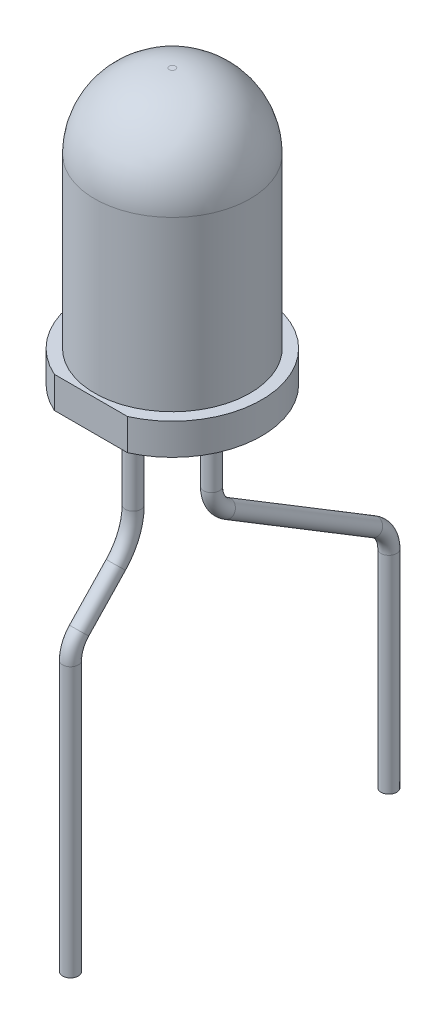
ISO-10303-21;
HEADER;
FILE_DESCRIPTION(('STEP AP214'),'2;1');
FILE_NAME('part.step','',(''),(''),'','','');
FILE_SCHEMA(('AUTOMOTIVE_DESIGN { 1 0 10303 214 1 1 1 1 }'));
ENDSEC;
DATA;
#1=APPLICATION_CONTEXT('core data for automotive mechanical design processes');
#2=APPLICATION_PROTOCOL_DEFINITION('international standard','automotive_design',2000,#1);
#3=PRODUCT_CONTEXT('',#1,'mechanical');
#4=PRODUCT('Part','Part','',(#3));
#5=PRODUCT_RELATED_PRODUCT_CATEGORY('part','',(#4));
#6=PRODUCT_DEFINITION_FORMATION('','',#4);
#7=PRODUCT_DEFINITION_CONTEXT('part definition',#1,'design');
#8=PRODUCT_DEFINITION('design','',#6,#7);
#9=PRODUCT_DEFINITION_SHAPE('','',#8);
#10=(LENGTH_UNIT() NAMED_UNIT(*) SI_UNIT(.MILLI.,.METRE.));
#11=(NAMED_UNIT(*) PLANE_ANGLE_UNIT() SI_UNIT($,.RADIAN.));
#12=(NAMED_UNIT(*) SI_UNIT($,.STERADIAN.) SOLID_ANGLE_UNIT());
#13=UNCERTAINTY_MEASURE_WITH_UNIT(LENGTH_MEASURE(1.E-05),#10,'distance_accuracy_value','');
#14=(GEOMETRIC_REPRESENTATION_CONTEXT(3) GLOBAL_UNCERTAINTY_ASSIGNED_CONTEXT((#13)) GLOBAL_UNIT_ASSIGNED_CONTEXT((#10,
#11,#12)) REPRESENTATION_CONTEXT('',''));
#15=CARTESIAN_POINT('',(0.,0.,0.));
#16=DIRECTION('',(0.,0.,1.));
#17=DIRECTION('',(1.,0.,0.));
#18=AXIS2_PLACEMENT_3D('',#15,#16,#17);
#19=CARTESIAN_POINT('',(0.15,1.5,-1.5));
#20=DIRECTION('',(0.,0.,1.));
#21=DIRECTION('',(1.,0.,0.));
#22=AXIS2_PLACEMENT_3D('',#19,#20,#21);
#23=PLANE('',#22);
#24=DIRECTION('',(0.,1.,0.));
#25=VECTOR('',#24,1.);
#26=CARTESIAN_POINT('',(0.15,1.5,-1.5));
#27=LINE('',#26,#25);
#28=CARTESIAN_POINT('',(0.15,1.2,-1.5));
#29=VERTEX_POINT('',#28);
#30=CARTESIAN_POINT('',(0.15,1.77671477649962,-1.5));
#31=VERTEX_POINT('',#30);
#32=EDGE_CURVE('E131',#29,#31,#27,.T.);
#33=ORIENTED_EDGE('',*,*,#32,.F.);
#34=DIRECTION('',(-1.,0.,0.));
#35=VECTOR('',#34,1.);
#36=CARTESIAN_POINT('',(0.15,1.2,-1.5));
#37=LINE('',#36,#35);
#38=CARTESIAN_POINT('',(-0.15,1.2,-1.5));
#39=VERTEX_POINT('',#38);
#40=EDGE_CURVE('E116',#29,#39,#37,.T.);
#41=ORIENTED_EDGE('',*,*,#40,.T.);
#42=DIRECTION('',(0.,1.,0.));
#43=VECTOR('',#42,1.);
#44=CARTESIAN_POINT('',(-0.15,1.5,-1.5));
#45=LINE('',#44,#43);
#46=CARTESIAN_POINT('',(-0.15,1.77671477649962,-1.5));
#47=VERTEX_POINT('',#46);
#48=EDGE_CURVE('E128',#39,#47,#45,.T.);
#49=ORIENTED_EDGE('',*,*,#48,.T.);
#50=DIRECTION('',(-1.,0.,0.));
#51=VECTOR('',#50,1.);
#52=CARTESIAN_POINT('',(0.15,1.77671477649962,-1.5));
#53=LINE('',#52,#51);
#54=EDGE_CURVE('E133',#47,#31,#53,.F.);
#55=ORIENTED_EDGE('',*,*,#54,.T.);
#56=EDGE_LOOP('',(#33,#41,#49,#55));
#57=FACE_BOUND('',#56,.T.);
#58=ADVANCED_FACE('F46',(#57),#23,.F.);
#59=CARTESIAN_POINT('',(0.15,2.29903730305671,-0.93397513129553));
#60=DIRECTION('',(-1.,0.,0.));
#61=DIRECTION('',(0.,0.,1.));
#62=AXIS2_PLACEMENT_3D('',#59,#60,#61);
#63=CYLINDRICAL_SURFACE('',#62,0.6);
#64=CARTESIAN_POINT('',(-0.15,2.29903730305671,-0.93397513129553));
#65=DIRECTION('',(-1.,0.,0.));
#66=DIRECTION('',(0.,0.,1.));
#67=AXIS2_PLACEMENT_3D('',#64,#65,#66);
#68=CIRCLE('',#67,0.6);
#69=CARTESIAN_POINT('',(-0.15,1.85133228029349,-1.3334250187565));
#70=VERTEX_POINT('',#69);
#71=CARTESIAN_POINT('',(-0.15,1.70171221463483,-0.990567875899361));
#72=VERTEX_POINT('',#71);
#73=EDGE_CURVE('E137',#70,#72,#68,.T.);
#74=ORIENTED_EDGE('',*,*,#73,.T.);
#75=DIRECTION('',(-1.,0.,0.));
#76=VECTOR('',#75,1.);
#77=CARTESIAN_POINT('',(0.15,1.70171221463483,-0.990567875899361));
#78=LINE('',#77,#76);
#79=CARTESIAN_POINT('',(0.15,1.70171221463483,-0.990567875899361));
#80=VERTEX_POINT('',#79);
#81=EDGE_CURVE('E12',#72,#80,#78,.F.);
#82=ORIENTED_EDGE('',*,*,#81,.T.);
#83=CARTESIAN_POINT('',(0.15,2.29903730305671,-0.93397513129553));
#84=DIRECTION('',(-1.,0.,0.));
#85=DIRECTION('',(0.,0.,1.));
#86=AXIS2_PLACEMENT_3D('',#83,#84,#85);
#87=CIRCLE('',#86,0.6);
#88=CARTESIAN_POINT('',(0.15,1.85133228029349,-1.3334250187565));
#89=VERTEX_POINT('',#88);
#90=EDGE_CURVE('E173',#89,#80,#87,.T.);
#91=ORIENTED_EDGE('',*,*,#90,.F.);
#92=DIRECTION('',(-1.,0.,0.));
#93=VECTOR('',#92,1.);
#94=CARTESIAN_POINT('',(0.15,1.85133228029349,-1.3334250187565));
#95=LINE('',#94,#93);
#96=EDGE_CURVE('E54',#89,#70,#95,.T.);
#97=ORIENTED_EDGE('',*,*,#96,.T.);
#98=EDGE_LOOP('',(#74,#82,#91,#97));
#99=FACE_BOUND('',#98,.T.);
#100=ADVANCED_FACE('F171',(#99),#63,.F.);
#101=CARTESIAN_POINT('',(0.15,1.1,-0.9));
#102=DIRECTION('',(0.,0.,-1.));
#103=DIRECTION('',(-1.,0.,0.));
#104=AXIS2_PLACEMENT_3D('',#101,#102,#103);
#105=PLANE('',#104);
#106=DIRECTION('',(0.,-1.,0.));
#107=VECTOR('',#106,1.);
#108=CARTESIAN_POINT('',(-0.15,1.1,-0.9));
#109=LINE('',#108,#107);
#110=CARTESIAN_POINT('',(-0.15,1.60215803323118,-0.9));
#111=VERTEX_POINT('',#110);
#112=CARTESIAN_POINT('',(-0.15,1.2,-0.9));
#113=VERTEX_POINT('',#112);
#114=EDGE_CURVE('E140',#111,#113,#109,.T.);
#115=ORIENTED_EDGE('',*,*,#114,.T.);
#116=DIRECTION('',(-1.,0.,0.));
#117=VECTOR('',#116,1.);
#118=CARTESIAN_POINT('',(0.15,1.2,-0.9));
#119=LINE('',#118,#117);
#120=CARTESIAN_POINT('',(0.15,1.2,-0.9));
#121=VERTEX_POINT('',#120);
#122=EDGE_CURVE('E61',#113,#121,#119,.F.);
#123=ORIENTED_EDGE('',*,*,#122,.T.);
#124=DIRECTION('',(0.,-1.,0.));
#125=VECTOR('',#124,1.);
#126=CARTESIAN_POINT('',(0.15,1.1,-0.9));
#127=LINE('',#126,#125);
#128=CARTESIAN_POINT('',(0.15,1.60215803323118,-0.9));
#129=VERTEX_POINT('',#128);
#130=EDGE_CURVE('E181',#129,#121,#127,.T.);
#131=ORIENTED_EDGE('',*,*,#130,.F.);
#132=DIRECTION('',(-1.,0.,0.));
#133=VECTOR('',#132,1.);
#134=CARTESIAN_POINT('',(0.15,1.60215803323118,-0.9));
#135=LINE('',#134,#133);
#136=EDGE_CURVE('E164',#129,#111,#135,.T.);
#137=ORIENTED_EDGE('',*,*,#136,.T.);
#138=EDGE_LOOP('',(#115,#123,#131,#137));
#139=FACE_BOUND('',#138,.T.);
#140=ADVANCED_FACE('F180',(#139),#105,.F.);
#141=CARTESIAN_POINT('',(0.15,1.1,-1.5));
#142=DIRECTION('',(0.,1.,0.));
#143=DIRECTION('',(0.,0.,1.));
#144=AXIS2_PLACEMENT_3D('',#141,#142,#143);
#145=PLANE('',#144);
#146=DIRECTION('',(0.,0.,-1.));
#147=VECTOR('',#146,1.);
#148=CARTESIAN_POINT('',(-0.15,1.1,-1.5));
#149=LINE('',#148,#147);
#150=CARTESIAN_POINT('',(-0.15,1.1,-1.));
#151=VERTEX_POINT('',#150);
#152=CARTESIAN_POINT('',(-0.15,1.1,-1.4));
#153=VERTEX_POINT('',#152);
#154=EDGE_CURVE('E147',#151,#153,#149,.T.);
#155=ORIENTED_EDGE('',*,*,#154,.T.);
#156=DIRECTION('',(-1.,0.,0.));
#157=VECTOR('',#156,1.);
#158=CARTESIAN_POINT('',(0.15,1.1,-1.4));
#159=LINE('',#158,#157);
#160=CARTESIAN_POINT('',(0.15,1.1,-1.4));
#161=VERTEX_POINT('',#160);
#162=EDGE_CURVE('E117',#153,#161,#159,.F.);
#163=ORIENTED_EDGE('',*,*,#162,.T.);
#164=DIRECTION('',(0.,0.,-1.));
#165=VECTOR('',#164,1.);
#166=CARTESIAN_POINT('',(0.15,1.1,-1.5));
#167=LINE('',#166,#165);
#168=CARTESIAN_POINT('',(0.15,1.1,-1.));
#169=VERTEX_POINT('',#168);
#170=EDGE_CURVE('E143',#169,#161,#167,.T.);
#171=ORIENTED_EDGE('',*,*,#170,.F.);
#172=DIRECTION('',(-1.,0.,0.));
#173=VECTOR('',#172,1.);
#174=CARTESIAN_POINT('',(0.15,1.1,-1.));
#175=LINE('',#174,#173);
#176=EDGE_CURVE('E122',#169,#151,#175,.T.);
#177=ORIENTED_EDGE('',*,*,#176,.T.);
#178=EDGE_LOOP('',(#155,#163,#171,#177));
#179=FACE_BOUND('',#178,.T.);
#180=ADVANCED_FACE('F209',(#179),#145,.F.);
#181=CARTESIAN_POINT('',(0.15,2.29903730305671,-0.93397513129553));
#182=DIRECTION('',(-1.,0.,0.));
#183=DIRECTION('',(0.,0.,1.));
#184=AXIS2_PLACEMENT_3D('',#181,#182,#183);
#185=PLANE('',#184);
#186=ORIENTED_EDGE('',*,*,#170,.T.);
#187=CARTESIAN_POINT('',(0.15,1.2,-1.4));
#188=DIRECTION('',(-1.,0.,0.));
#189=DIRECTION('',(0.,0.,1.));
#190=AXIS2_PLACEMENT_3D('',#187,#188,#189);
#191=CIRCLE('',#190,0.1);
#192=EDGE_CURVE('E162',#161,#29,#191,.F.);
#193=ORIENTED_EDGE('',*,*,#192,.T.);
#194=ORIENTED_EDGE('',*,*,#32,.T.);
#195=CARTESIAN_POINT('',(0.15,1.77671477649962,-1.4));
#196=DIRECTION('',(-1.,0.,0.));
#197=DIRECTION('',(0.,0.,1.));
#198=AXIS2_PLACEMENT_3D('',#195,#196,#197);
#199=CIRCLE('',#198,0.1);
#200=EDGE_CURVE('E157',#31,#89,#199,.F.);
#201=ORIENTED_EDGE('',*,*,#200,.T.);
#202=ORIENTED_EDGE('',*,*,#90,.T.);
#203=CARTESIAN_POINT('',(0.15,1.60215803323118,-1.));
#204=DIRECTION('',(-1.,0.,0.));
#205=DIRECTION('',(0.,0.,1.));
#206=AXIS2_PLACEMENT_3D('',#203,#204,#205);
#207=CIRCLE('',#206,0.1);
#208=EDGE_CURVE('E68',#80,#129,#207,.F.);
#209=ORIENTED_EDGE('',*,*,#208,.T.);
#210=ORIENTED_EDGE('',*,*,#130,.T.);
#211=CARTESIAN_POINT('',(0.15,1.2,-1.));
#212=DIRECTION('',(-1.,0.,0.));
#213=DIRECTION('',(0.,0.,1.));
#214=AXIS2_PLACEMENT_3D('',#211,#212,#213);
#215=CIRCLE('',#214,0.1);
#216=EDGE_CURVE('E160',#121,#169,#215,.F.);
#217=ORIENTED_EDGE('',*,*,#216,.T.);
#218=EDGE_LOOP('',(#186,#193,#194,#201,#202,#209,#210,#217));
#219=FACE_BOUND('',#218,.T.);
#220=ADVANCED_FACE('F186',(#219),#185,.F.);
#221=CARTESIAN_POINT('',(-0.15,2.29903730305671,-0.93397513129553));
#222=DIRECTION('',(-1.,0.,0.));
#223=DIRECTION('',(0.,0.,1.));
#224=AXIS2_PLACEMENT_3D('',#221,#222,#223);
#225=PLANE('',#224);
#226=ORIENTED_EDGE('',*,*,#48,.F.);
#227=CARTESIAN_POINT('',(-0.15,1.2,-1.4));
#228=DIRECTION('',(-1.,0.,0.));
#229=DIRECTION('',(0.,0.,1.));
#230=AXIS2_PLACEMENT_3D('',#227,#228,#229);
#231=CIRCLE('',#230,0.1);
#232=EDGE_CURVE('E112',#39,#153,#231,.T.);
#233=ORIENTED_EDGE('',*,*,#232,.T.);
#234=ORIENTED_EDGE('',*,*,#154,.F.);
#235=CARTESIAN_POINT('',(-0.15,1.2,-1.));
#236=DIRECTION('',(-1.,0.,0.));
#237=DIRECTION('',(0.,0.,1.));
#238=AXIS2_PLACEMENT_3D('',#235,#236,#237);
#239=CIRCLE('',#238,0.1);
#240=EDGE_CURVE('E123',#151,#113,#239,.T.);
#241=ORIENTED_EDGE('',*,*,#240,.T.);
#242=ORIENTED_EDGE('',*,*,#114,.F.);
#243=CARTESIAN_POINT('',(-0.15,1.60215803323118,-1.));
#244=DIRECTION('',(-1.,0.,0.));
#245=DIRECTION('',(0.,0.,1.));
#246=AXIS2_PLACEMENT_3D('',#243,#244,#245);
#247=CIRCLE('',#246,0.1);
#248=EDGE_CURVE('E151',#111,#72,#247,.T.);
#249=ORIENTED_EDGE('',*,*,#248,.T.);
#250=ORIENTED_EDGE('',*,*,#73,.F.);
#251=CARTESIAN_POINT('',(-0.15,1.77671477649962,-1.4));
#252=DIRECTION('',(-1.,0.,0.));
#253=DIRECTION('',(0.,0.,1.));
#254=AXIS2_PLACEMENT_3D('',#251,#252,#253);
#255=CIRCLE('',#254,0.1);
#256=EDGE_CURVE('E132',#70,#47,#255,.T.);
#257=ORIENTED_EDGE('',*,*,#256,.T.);
#258=EDGE_LOOP('',(#226,#233,#234,#241,#242,#249,#250,#257));
#259=FACE_BOUND('',#258,.T.);
#260=ADVANCED_FACE('F135',(#259),#225,.T.);
#261=CARTESIAN_POINT('',(0.15,1.2,-1.4));
#262=DIRECTION('',(-1.,0.,0.));
#263=DIRECTION('',(0.,0.,1.));
#264=AXIS2_PLACEMENT_3D('',#261,#262,#263);
#265=CYLINDRICAL_SURFACE('',#264,0.1);
#266=ORIENTED_EDGE('',*,*,#192,.F.);
#267=ORIENTED_EDGE('',*,*,#162,.F.);
#268=ORIENTED_EDGE('',*,*,#232,.F.);
#269=ORIENTED_EDGE('',*,*,#40,.F.);
#270=EDGE_LOOP('',(#266,#267,#268,#269));
#271=FACE_BOUND('',#270,.T.);
#272=ADVANCED_FACE('F115',(#271),#265,.T.);
#273=CARTESIAN_POINT('',(0.15,1.2,-1.));
#274=DIRECTION('',(-1.,0.,0.));
#275=DIRECTION('',(0.,0.,1.));
#276=AXIS2_PLACEMENT_3D('',#273,#274,#275);
#277=CYLINDRICAL_SURFACE('',#276,0.1);
#278=ORIENTED_EDGE('',*,*,#216,.F.);
#279=ORIENTED_EDGE('',*,*,#122,.F.);
#280=ORIENTED_EDGE('',*,*,#240,.F.);
#281=ORIENTED_EDGE('',*,*,#176,.F.);
#282=EDGE_LOOP('',(#278,#279,#280,#281));
#283=FACE_BOUND('',#282,.T.);
#284=ADVANCED_FACE('F191',(#283),#277,.T.);
#285=CARTESIAN_POINT('',(0.15,1.60215803323118,-1.));
#286=DIRECTION('',(-1.,0.,0.));
#287=DIRECTION('',(0.,0.,1.));
#288=AXIS2_PLACEMENT_3D('',#285,#286,#287);
#289=CYLINDRICAL_SURFACE('',#288,0.1);
#290=ORIENTED_EDGE('',*,*,#208,.F.);
#291=ORIENTED_EDGE('',*,*,#81,.F.);
#292=ORIENTED_EDGE('',*,*,#248,.F.);
#293=ORIENTED_EDGE('',*,*,#136,.F.);
#294=EDGE_LOOP('',(#290,#291,#292,#293));
#295=FACE_BOUND('',#294,.T.);
#296=ADVANCED_FACE('F179',(#295),#289,.T.);
#297=CARTESIAN_POINT('',(0.15,1.77671477649962,-1.4));
#298=DIRECTION('',(-1.,0.,0.));
#299=DIRECTION('',(0.,0.,1.));
#300=AXIS2_PLACEMENT_3D('',#297,#298,#299);
#301=CYLINDRICAL_SURFACE('',#300,0.1);
#302=ORIENTED_EDGE('',*,*,#200,.F.);
#303=ORIENTED_EDGE('',*,*,#54,.F.);
#304=ORIENTED_EDGE('',*,*,#256,.F.);
#305=ORIENTED_EDGE('',*,*,#96,.F.);
#306=EDGE_LOOP('',(#302,#303,#304,#305));
#307=FACE_BOUND('',#306,.T.);
#308=ADVANCED_FACE('F48',(#307),#301,.T.);
#309=CLOSED_SHELL('',(#58,#100,#140,#180,#220,#260,#272,#284,#296,#308));
#310=MANIFOLD_SOLID_BREP('B2',#309);
#311=CARTESIAN_POINT('',(0.,3.,-1.25));
#312=DIRECTION('',(0.,-1.,0.));
#313=DIRECTION('',(0.,0.,-1.));
#314=AXIS2_PLACEMENT_3D('',#311,#312,#313);
#315=CYLINDRICAL_SURFACE('',#314,0.25);
#316=CARTESIAN_POINT('',(0.,1.4,-1.25));
#317=DIRECTION('',(0.,1.,0.));
#318=DIRECTION('',(0.,0.,1.));
#319=AXIS2_PLACEMENT_3D('',#316,#317,#318);
#320=CIRCLE('',#319,0.25);
#321=CARTESIAN_POINT('',(0.,1.4,-1.));
#322=VERTEX_POINT('',#321);
#323=EDGE_CURVE('E45',#322,#322,#320,.F.);
#324=ORIENTED_EDGE('',*,*,#323,.T.);
#325=EDGE_LOOP('',(#324));
#326=FACE_BOUND('',#325,.T.);
#327=CARTESIAN_POINT('',(0.,0.,-1.25));
#328=DIRECTION('',(0.,-1.,0.));
#329=DIRECTION('',(0.,0.,-1.));
#330=AXIS2_PLACEMENT_3D('',#327,#328,#329);
#331=CIRCLE('',#330,0.25);
#332=CARTESIAN_POINT('',(0.,0.,-1.5));
#333=VERTEX_POINT('',#332);
#334=EDGE_CURVE('E298',#333,#333,#331,.T.);
#335=ORIENTED_EDGE('',*,*,#334,.F.);
#336=EDGE_LOOP('',(#335));
#337=FACE_BOUND('',#336,.T.);
#338=ADVANCED_FACE('F287',(#326,#337),#315,.T.);
#339=CARTESIAN_POINT('',(0.,0.,-1.25));
#340=DIRECTION('',(0.,-1.,0.));
#341=DIRECTION('',(0.,0.,-1.));
#342=AXIS2_PLACEMENT_3D('',#339,#340,#341);
#343=PLANE('',#342);
#344=ORIENTED_EDGE('',*,*,#334,.T.);
#345=EDGE_LOOP('',(#344));
#346=FACE_BOUND('',#345,.T.);
#347=ADVANCED_FACE('F305',(#346),#343,.T.);
#348=CARTESIAN_POINT('',(0.,1.5,-1.25));
#349=DIRECTION('',(0.,1.,0.));
#350=DIRECTION('',(0.,0.,1.));
#351=AXIS2_PLACEMENT_3D('',#348,#349,#350);
#352=PLANE('',#351);
#353=CARTESIAN_POINT('',(0.,1.5,-1.25));
#354=DIRECTION('',(0.,1.,0.));
#355=DIRECTION('',(0.,0.,1.));
#356=AXIS2_PLACEMENT_3D('',#353,#354,#355);
#357=CIRCLE('',#356,0.15);
#358=CARTESIAN_POINT('',(0.,1.5,-1.1));
#359=VERTEX_POINT('',#358);
#360=EDGE_CURVE('E294',#359,#359,#357,.T.);
#361=ORIENTED_EDGE('',*,*,#360,.T.);
#362=EDGE_LOOP('',(#361));
#363=FACE_BOUND('',#362,.T.);
#364=ADVANCED_FACE('F311',(#363),#352,.T.);
#365=CARTESIAN_POINT('',(0.,1.4,-1.25));
#366=DIRECTION('',(0.,1.,0.));
#367=DIRECTION('',(0.,0.,1.));
#368=AXIS2_PLACEMENT_3D('',#365,#366,#367);
#369=TOROIDAL_SURFACE('',#368,0.15,0.1);
#370=ORIENTED_EDGE('',*,*,#323,.F.);
#371=EDGE_LOOP('',(#370));
#372=FACE_BOUND('',#371,.T.);
#373=ORIENTED_EDGE('',*,*,#360,.F.);
#374=EDGE_LOOP('',(#373));
#375=FACE_BOUND('',#374,.T.);
#376=ADVANCED_FACE('F289',(#372,#375),#369,.T.);
#377=CLOSED_SHELL('',(#338,#347,#364,#376));
#378=MANIFOLD_SOLID_BREP('B6',#377);
#379=CARTESIAN_POINT('',(0.,3.,1.25));
#380=DIRECTION('',(0.,-1.,0.));
#381=DIRECTION('',(0.,0.,-1.));
#382=AXIS2_PLACEMENT_3D('',#379,#380,#381);
#383=CYLINDRICAL_SURFACE('',#382,0.25);
#384=DIRECTION('',(0.,-1.,0.));
#385=VECTOR('',#384,1.);
#386=CARTESIAN_POINT('',(0.15,3.,1.05));
#387=LINE('',#386,#385);
#388=CARTESIAN_POINT('',(0.15,3.,1.05));
#389=VERTEX_POINT('',#388);
#390=CARTESIAN_POINT('',(0.15,1.4,1.05));
#391=VERTEX_POINT('',#390);
#392=EDGE_CURVE('E426',#389,#391,#387,.T.);
#393=ORIENTED_EDGE('',*,*,#392,.F.);
#394=CARTESIAN_POINT('',(0.,3.,1.25));
#395=DIRECTION('',(0.,-1.,0.));
#396=DIRECTION('',(0.,0.,-1.));
#397=AXIS2_PLACEMENT_3D('',#394,#395,#396);
#398=CIRCLE('',#397,0.25);
#399=CARTESIAN_POINT('',(-0.15,3.,1.05));
#400=VERTEX_POINT('',#399);
#401=EDGE_CURVE('E485',#389,#400,#398,.T.);
#402=ORIENTED_EDGE('',*,*,#401,.T.);
#403=DIRECTION('',(0.,-1.,0.));
#404=VECTOR('',#403,1.);
#405=CARTESIAN_POINT('',(-0.15,3.,1.05));
#406=LINE('',#405,#404);
#407=CARTESIAN_POINT('',(-0.15,1.4,1.05));
#408=VERTEX_POINT('',#407);
#409=EDGE_CURVE('E370',#400,#408,#406,.T.);
#410=ORIENTED_EDGE('',*,*,#409,.T.);
#411=CARTESIAN_POINT('',(0.,1.4,1.25));
#412=DIRECTION('',(0.,1.,0.));
#413=DIRECTION('',(0.,0.,1.));
#414=AXIS2_PLACEMENT_3D('',#411,#412,#413);
#415=CIRCLE('',#414,0.25);
#416=EDGE_CURVE('E285',#408,#391,#415,.F.);
#417=ORIENTED_EDGE('',*,*,#416,.T.);
#418=EDGE_LOOP('',(#393,#402,#410,#417));
#419=FACE_BOUND('',#418,.T.);
#420=CARTESIAN_POINT('',(0.,0.,1.25));
#421=DIRECTION('',(0.,-1.,0.));
#422=DIRECTION('',(0.,0.,-1.));
#423=AXIS2_PLACEMENT_3D('',#420,#421,#422);
#424=CIRCLE('',#423,0.25);
#425=CARTESIAN_POINT('',(0.,0.,1.));
#426=VERTEX_POINT('',#425);
#427=EDGE_CURVE('E487',#426,#426,#424,.T.);
#428=ORIENTED_EDGE('',*,*,#427,.F.);
#429=EDGE_LOOP('',(#428));
#430=FACE_BOUND('',#429,.T.);
#431=ADVANCED_FACE('F352',(#419,#430),#383,.T.);
#432=CARTESIAN_POINT('',(0.,0.,1.25));
#433=DIRECTION('',(0.,-1.,0.));
#434=DIRECTION('',(0.,0.,-1.));
#435=AXIS2_PLACEMENT_3D('',#432,#433,#434);
#436=PLANE('',#435);
#437=ORIENTED_EDGE('',*,*,#427,.T.);
#438=EDGE_LOOP('',(#437));
#439=FACE_BOUND('',#438,.T.);
#440=ADVANCED_FACE('F523',(#439),#436,.T.);
#441=CARTESIAN_POINT('',(0.,3.2,1.25));
#442=DIRECTION('',(0.,-1.,0.));
#443=DIRECTION('',(0.,0.,-1.));
#444=AXIS2_PLACEMENT_3D('',#441,#442,#443);
#445=CYLINDRICAL_SURFACE('',#444,0.5);
#446=CARTESIAN_POINT('',(0.,3.05,1.25));
#447=DIRECTION('',(0.,1.,0.));
#448=DIRECTION('',(0.,0.,1.));
#449=AXIS2_PLACEMENT_3D('',#446,#447,#448);
#450=CIRCLE('',#449,0.5);
#451=CARTESIAN_POINT('',(0.,3.05,1.75));
#452=VERTEX_POINT('',#451);
#453=EDGE_CURVE('E493',#452,#452,#450,.F.);
#454=ORIENTED_EDGE('',*,*,#453,.T.);
#455=EDGE_LOOP('',(#454));
#456=FACE_BOUND('',#455,.T.);
#457=CARTESIAN_POINT('',(0.,3.,1.25));
#458=DIRECTION('',(0.,1.,0.));
#459=DIRECTION('',(0.,0.,1.));
#460=AXIS2_PLACEMENT_3D('',#457,#458,#459);
#461=CIRCLE('',#460,0.5);
#462=CARTESIAN_POINT('',(0.15,3.,0.773030399291527));
#463=VERTEX_POINT('',#462);
#464=CARTESIAN_POINT('',(-0.15,3.,0.773030399291527));
#465=VERTEX_POINT('',#464);
#466=EDGE_CURVE('E483',#463,#465,#461,.T.);
#467=ORIENTED_EDGE('',*,*,#466,.T.);
#468=EDGE_CURVE('E482',#465,#463,#461,.T.);
#469=ORIENTED_EDGE('',*,*,#468,.T.);
#470=EDGE_LOOP('',(#467,#469));
#471=FACE_BOUND('',#470,.T.);
#472=ADVANCED_FACE('F506',(#456,#471),#445,.T.);
#473=CARTESIAN_POINT('',(0.,3.2,1.25));
#474=DIRECTION('',(0.,1.,0.));
#475=DIRECTION('',(0.,0.,1.));
#476=AXIS2_PLACEMENT_3D('',#473,#474,#475);
#477=PLANE('',#476);
#478=CARTESIAN_POINT('',(0.,3.2,1.25));
#479=DIRECTION('',(0.,1.,0.));
#480=DIRECTION('',(0.,0.,1.));
#481=AXIS2_PLACEMENT_3D('',#478,#479,#480);
#482=CIRCLE('',#481,0.35);
#483=CARTESIAN_POINT('',(0.,3.2,1.6));
#484=VERTEX_POINT('',#483);
#485=EDGE_CURVE('E490',#484,#484,#482,.T.);
#486=ORIENTED_EDGE('',*,*,#485,.T.);
#487=EDGE_LOOP('',(#486));
#488=FACE_BOUND('',#487,.T.);
#489=ADVANCED_FACE('F531',(#488),#477,.T.);
#490=CARTESIAN_POINT('',(0.,3.,1.25));
#491=DIRECTION('',(0.,1.,0.));
#492=DIRECTION('',(0.,0.,1.));
#493=AXIS2_PLACEMENT_3D('',#490,#491,#492);
#494=PLANE('',#493);
#495=ORIENTED_EDGE('',*,*,#401,.F.);
#496=DIRECTION('',(0.,0.,-1.));
#497=VECTOR('',#496,1.);
#498=CARTESIAN_POINT('',(0.15,3.,1.25));
#499=LINE('',#498,#497);
#500=EDGE_CURVE('E360',#389,#463,#499,.T.);
#501=ORIENTED_EDGE('',*,*,#500,.T.);
#502=ORIENTED_EDGE('',*,*,#468,.F.);
#503=DIRECTION('',(0.,0.,-1.));
#504=VECTOR('',#503,1.);
#505=CARTESIAN_POINT('',(-0.15,3.,1.25));
#506=LINE('',#505,#504);
#507=EDGE_CURVE('E496',#400,#465,#506,.T.);
#508=ORIENTED_EDGE('',*,*,#507,.F.);
#509=EDGE_LOOP('',(#495,#501,#502,#508));
#510=FACE_BOUND('',#509,.T.);
#511=ADVANCED_FACE('F502',(#510),#494,.F.);
#512=CARTESIAN_POINT('',(0.,3.05,1.25));
#513=DIRECTION('',(0.,1.,0.));
#514=DIRECTION('',(0.,0.,1.));
#515=AXIS2_PLACEMENT_3D('',#512,#513,#514);
#516=TOROIDAL_SURFACE('',#515,0.35,0.15);
#517=ORIENTED_EDGE('',*,*,#453,.F.);
#518=EDGE_LOOP('',(#517));
#519=FACE_BOUND('',#518,.T.);
#520=ORIENTED_EDGE('',*,*,#485,.F.);
#521=EDGE_LOOP('',(#520));
#522=FACE_BOUND('',#521,.T.);
#523=ADVANCED_FACE('F354',(#519,#522),#516,.T.);
#524=CARTESIAN_POINT('',(0.15,3.,-0.145718677729039));
#525=DIRECTION('',(0.,-1.,0.));
#526=DIRECTION('',(0.,0.,-1.));
#527=AXIS2_PLACEMENT_3D('',#524,#525,#526);
#528=PLANE('',#527);
#529=DIRECTION('',(0.,0.,1.));
#530=VECTOR('',#529,1.);
#531=CARTESIAN_POINT('',(-0.15,3.,-0.145718677729039));
#532=LINE('',#531,#530);
#533=CARTESIAN_POINT('',(-0.15,3.,-0.145718677729039));
#534=VERTEX_POINT('',#533);
#535=EDGE_CURVE('E454',#534,#465,#532,.T.);
#536=ORIENTED_EDGE('',*,*,#535,.T.);
#537=ORIENTED_EDGE('',*,*,#466,.F.);
#538=DIRECTION('',(0.,0.,1.));
#539=VECTOR('',#538,1.);
#540=CARTESIAN_POINT('',(0.15,3.,-0.145718677729039));
#541=LINE('',#540,#539);
#542=CARTESIAN_POINT('',(0.15,3.,-0.145718677729039));
#543=VERTEX_POINT('',#542);
#544=EDGE_CURVE('E428',#543,#463,#541,.T.);
#545=ORIENTED_EDGE('',*,*,#544,.F.);
#546=DIRECTION('',(-1.,0.,0.));
#547=VECTOR('',#546,1.);
#548=CARTESIAN_POINT('',(0.15,3.,-0.145718677729039));
#549=LINE('',#548,#547);
#550=EDGE_CURVE('E453',#543,#534,#549,.T.);
#551=ORIENTED_EDGE('',*,*,#550,.T.);
#552=EDGE_LOOP('',(#536,#537,#545,#551));
#553=FACE_BOUND('',#552,.T.);
#554=ADVANCED_FACE('F509',(#553),#528,.F.);
#555=CARTESIAN_POINT('',(0.15,1.4,1.25));
#556=DIRECTION('',(0.,1.,0.));
#557=DIRECTION('',(0.,0.,1.));
#558=AXIS2_PLACEMENT_3D('',#555,#556,#557);
#559=PLANE('',#558);
#560=ORIENTED_EDGE('',*,*,#416,.F.);
#561=DIRECTION('',(0.,0.,-1.));
#562=VECTOR('',#561,1.);
#563=CARTESIAN_POINT('',(-0.15,1.4,1.25));
#564=LINE('',#563,#562);
#565=CARTESIAN_POINT('',(-0.15,1.4,0.75));
#566=VERTEX_POINT('',#565);
#567=EDGE_CURVE('E434',#408,#566,#564,.T.);
#568=ORIENTED_EDGE('',*,*,#567,.T.);
#569=DIRECTION('',(-1.,0.,0.));
#570=VECTOR('',#569,1.);
#571=CARTESIAN_POINT('',(0.15,1.4,0.75));
#572=LINE('',#571,#570);
#573=CARTESIAN_POINT('',(0.15,1.4,0.75));
#574=VERTEX_POINT('',#573);
#575=EDGE_CURVE('E431',#574,#566,#572,.T.);
#576=ORIENTED_EDGE('',*,*,#575,.F.);
#577=DIRECTION('',(0.,0.,-1.));
#578=VECTOR('',#577,1.);
#579=CARTESIAN_POINT('',(0.15,1.4,1.25));
#580=LINE('',#579,#578);
#581=EDGE_CURVE('E419',#391,#574,#580,.T.);
#582=ORIENTED_EDGE('',*,*,#581,.F.);
#583=EDGE_LOOP('',(#560,#568,#576,#582));
#584=FACE_BOUND('',#583,.T.);
#585=ADVANCED_FACE('F432',(#584),#559,.F.);
#586=CARTESIAN_POINT('',(0.15,3.4,0.75));
#587=DIRECTION('',(-1.,0.,0.));
#588=DIRECTION('',(0.,0.,1.));
#589=AXIS2_PLACEMENT_3D('',#586,#587,#588);
#590=CYLINDRICAL_SURFACE('',#589,2.);
#591=CARTESIAN_POINT('',(-0.15,3.4,0.75));
#592=DIRECTION('',(1.,0.,0.));
#593=DIRECTION('',(0.,0.,-1.));
#594=AXIS2_PLACEMENT_3D('',#591,#592,#593);
#595=CIRCLE('',#594,2.);
#596=CARTESIAN_POINT('',(-0.15,1.76169591142201,-0.397152872702083));
#597=VERTEX_POINT('',#596);
#598=EDGE_CURVE('E458',#566,#597,#595,.T.);
#599=ORIENTED_EDGE('',*,*,#598,.T.);
#600=DIRECTION('',(-1.,0.,0.));
#601=VECTOR('',#600,1.);
#602=CARTESIAN_POINT('',(0.15,1.76169591142201,-0.397152872702083));
#603=LINE('',#602,#601);
#604=CARTESIAN_POINT('',(0.15,1.76169591142201,-0.397152872702083));
#605=VERTEX_POINT('',#604);
#606=EDGE_CURVE('E437',#605,#597,#603,.T.);
#607=ORIENTED_EDGE('',*,*,#606,.F.);
#608=CARTESIAN_POINT('',(0.15,3.4,0.75));
#609=DIRECTION('',(1.,0.,0.));
#610=DIRECTION('',(0.,0.,-1.));
#611=AXIS2_PLACEMENT_3D('',#608,#609,#610);
#612=CIRCLE('',#611,2.);
#613=EDGE_CURVE('E424',#574,#605,#612,.T.);
#614=ORIENTED_EDGE('',*,*,#613,.F.);
#615=ORIENTED_EDGE('',*,*,#575,.T.);
#616=EDGE_LOOP('',(#599,#607,#614,#615));
#617=FACE_BOUND('',#616,.T.);
#618=ADVANCED_FACE('F439',(#617),#590,.T.);
#619=CARTESIAN_POINT('',(0.15,1.76169591142201,-0.397152872702083));
#620=DIRECTION('',(0.,0.819152044288995,0.573576436351042));
#621=DIRECTION('',(0.,-0.573576436351042,0.819152044288995));
#622=AXIS2_PLACEMENT_3D('',#619,#620,#621);
#623=PLANE('',#622);
#624=DIRECTION('',(0.,0.573576436351042,-0.819152044288995));
#625=VECTOR('',#624,1.);
#626=CARTESIAN_POINT('',(-0.15,1.76169591142201,-0.397152872702083));
#627=LINE('',#626,#625);
#628=CARTESIAN_POINT('',(-0.15,2.46942357821169,-1.40789272934403));
#629=VERTEX_POINT('',#628);
#630=EDGE_CURVE('E460',#597,#629,#627,.T.);
#631=ORIENTED_EDGE('',*,*,#630,.T.);
#632=DIRECTION('',(-1.,0.,0.));
#633=VECTOR('',#632,1.);
#634=CARTESIAN_POINT('',(0.15,2.46942357821169,-1.40789272934403));
#635=LINE('',#634,#633);
#636=CARTESIAN_POINT('',(0.15,2.46942357821169,-1.40789272934403));
#637=VERTEX_POINT('',#636);
#638=EDGE_CURVE('E476',#637,#629,#635,.T.);
#639=ORIENTED_EDGE('',*,*,#638,.F.);
#640=DIRECTION('',(0.,0.573576436351042,-0.819152044288995));
#641=VECTOR('',#640,1.);
#642=CARTESIAN_POINT('',(0.15,1.76169591142201,-0.397152872702083));
#643=LINE('',#642,#641);
#644=EDGE_CURVE('E442',#605,#637,#643,.T.);
#645=ORIENTED_EDGE('',*,*,#644,.F.);
#646=ORIENTED_EDGE('',*,*,#606,.T.);
#647=EDGE_LOOP('',(#631,#639,#645,#646));
#648=FACE_BOUND('',#647,.T.);
#649=ADVANCED_FACE('F546',(#648),#623,.F.);
#650=CARTESIAN_POINT('',(0.15,2.55133878264059,-1.35053508570893));
#651=DIRECTION('',(-1.,0.,0.));
#652=DIRECTION('',(0.,0.,1.));
#653=AXIS2_PLACEMENT_3D('',#650,#651,#652);
#654=CYLINDRICAL_SURFACE('',#653,0.0999999999999998);
#655=CARTESIAN_POINT('',(-0.15,2.55133878264059,-1.35053508570893));
#656=DIRECTION('',(1.,0.,0.));
#657=DIRECTION('',(0.,0.,-1.));
#658=AXIS2_PLACEMENT_3D('',#655,#656,#657);
#659=CIRCLE('',#658,0.0999999999999998);
#660=CARTESIAN_POINT('',(-0.15,2.64329330345989,-1.38983350935281));
#661=VERTEX_POINT('',#660);
#662=EDGE_CURVE('E462',#629,#661,#659,.T.);
#663=ORIENTED_EDGE('',*,*,#662,.T.);
#664=DIRECTION('',(-1.,0.,0.));
#665=VECTOR('',#664,1.);
#666=CARTESIAN_POINT('',(0.15,2.64329330345989,-1.38983350935281));
#667=LINE('',#666,#665);
#668=CARTESIAN_POINT('',(0.15,2.64329330345989,-1.38983350935281));
#669=VERTEX_POINT('',#668);
#670=EDGE_CURVE('E473',#669,#661,#667,.T.);
#671=ORIENTED_EDGE('',*,*,#670,.F.);
#672=CARTESIAN_POINT('',(0.15,2.55133878264059,-1.35053508570893));
#673=DIRECTION('',(1.,0.,0.));
#674=DIRECTION('',(0.,0.,-1.));
#675=AXIS2_PLACEMENT_3D('',#672,#673,#674);
#676=CIRCLE('',#675,0.0999999999999998);
#677=EDGE_CURVE('E444',#637,#669,#676,.T.);
#678=ORIENTED_EDGE('',*,*,#677,.F.);
#679=ORIENTED_EDGE('',*,*,#638,.T.);
#680=EDGE_LOOP('',(#663,#671,#678,#679));
#681=FACE_BOUND('',#680,.T.);
#682=ADVANCED_FACE('F549',(#681),#654,.T.);
#683=CARTESIAN_POINT('',(0.15,2.64329330345989,-1.38983350935281));
#684=DIRECTION('',(0.,-0.919545208192912,0.392984236438886));
#685=DIRECTION('',(0.,-0.392984236438886,-0.919545208192912));
#686=AXIS2_PLACEMENT_3D('',#683,#684,#685);
#687=PLANE('',#686);
#688=DIRECTION('',(0.,0.392984236438886,0.919545208192912));
#689=VECTOR('',#688,1.);
#690=CARTESIAN_POINT('',(-0.15,2.64329330345989,-1.38983350935281));
#691=LINE('',#690,#689);
#692=CARTESIAN_POINT('',(-0.15,2.83909041638583,-0.931687150606808));
#693=VERTEX_POINT('',#692);
#694=EDGE_CURVE('E464',#661,#693,#691,.T.);
#695=ORIENTED_EDGE('',*,*,#694,.T.);
#696=DIRECTION('',(-1.,0.,0.));
#697=VECTOR('',#696,1.);
#698=CARTESIAN_POINT('',(0.15,2.83909041638583,-0.931687150606808));
#699=LINE('',#698,#697);
#700=CARTESIAN_POINT('',(0.15,2.83909041638583,-0.931687150606808));
#701=VERTEX_POINT('',#700);
#702=EDGE_CURVE('E470',#701,#693,#699,.T.);
#703=ORIENTED_EDGE('',*,*,#702,.F.);
#704=DIRECTION('',(0.,0.392984236438886,0.919545208192912));
#705=VECTOR('',#704,1.);
#706=CARTESIAN_POINT('',(0.15,2.64329330345989,-1.38983350935281));
#707=LINE('',#706,#705);
#708=EDGE_CURVE('E449',#669,#701,#707,.T.);
#709=ORIENTED_EDGE('',*,*,#708,.F.);
#710=ORIENTED_EDGE('',*,*,#670,.T.);
#711=EDGE_LOOP('',(#695,#703,#709,#710));
#712=FACE_BOUND('',#711,.T.);
#713=ADVANCED_FACE('F553',(#712),#687,.F.);
#714=CARTESIAN_POINT('',(0.15,1.,-0.145718677729039));
#715=DIRECTION('',(-1.,0.,0.));
#716=DIRECTION('',(0.,0.,1.));
#717=AXIS2_PLACEMENT_3D('',#714,#715,#716);
#718=CYLINDRICAL_SURFACE('',#717,2.);
#719=CARTESIAN_POINT('',(-0.15,1.,-0.145718677729039));
#720=DIRECTION('',(1.,0.,0.));
#721=DIRECTION('',(0.,0.,-1.));
#722=AXIS2_PLACEMENT_3D('',#719,#720,#721);
#723=CIRCLE('',#722,2.);
#724=EDGE_CURVE('E466',#693,#534,#723,.T.);
#725=ORIENTED_EDGE('',*,*,#724,.T.);
#726=ORIENTED_EDGE('',*,*,#550,.F.);
#727=CARTESIAN_POINT('',(0.15,1.,-0.145718677729039));
#728=DIRECTION('',(1.,0.,0.));
#729=DIRECTION('',(0.,0.,-1.));
#730=AXIS2_PLACEMENT_3D('',#727,#728,#729);
#731=CIRCLE('',#730,2.);
#732=EDGE_CURVE('E451',#701,#543,#731,.T.);
#733=ORIENTED_EDGE('',*,*,#732,.F.);
#734=ORIENTED_EDGE('',*,*,#702,.T.);
#735=EDGE_LOOP('',(#725,#726,#733,#734));
#736=FACE_BOUND('',#735,.T.);
#737=ADVANCED_FACE('F516',(#736),#718,.T.);
#738=CARTESIAN_POINT('',(0.15,3.4,0.75));
#739=DIRECTION('',(1.,0.,0.));
#740=DIRECTION('',(0.,0.,-1.));
#741=AXIS2_PLACEMENT_3D('',#738,#739,#740);
#742=PLANE('',#741);
#743=ORIENTED_EDGE('',*,*,#500,.F.);
#744=ORIENTED_EDGE('',*,*,#392,.T.);
#745=ORIENTED_EDGE('',*,*,#581,.T.);
#746=ORIENTED_EDGE('',*,*,#613,.T.);
#747=ORIENTED_EDGE('',*,*,#644,.T.);
#748=ORIENTED_EDGE('',*,*,#677,.T.);
#749=ORIENTED_EDGE('',*,*,#708,.T.);
#750=ORIENTED_EDGE('',*,*,#732,.T.);
#751=ORIENTED_EDGE('',*,*,#544,.T.);
#752=EDGE_LOOP('',(#743,#744,#745,#746,#747,#748,#749,#750,#751));
#753=FACE_BOUND('',#752,.T.);
#754=ADVANCED_FACE('F422',(#753),#742,.T.);
#755=CARTESIAN_POINT('',(-0.15,3.4,0.75));
#756=DIRECTION('',(1.,0.,0.));
#757=DIRECTION('',(0.,0.,-1.));
#758=AXIS2_PLACEMENT_3D('',#755,#756,#757);
#759=PLANE('',#758);
#760=ORIENTED_EDGE('',*,*,#409,.F.);
#761=ORIENTED_EDGE('',*,*,#507,.T.);
#762=ORIENTED_EDGE('',*,*,#535,.F.);
#763=ORIENTED_EDGE('',*,*,#724,.F.);
#764=ORIENTED_EDGE('',*,*,#694,.F.);
#765=ORIENTED_EDGE('',*,*,#662,.F.);
#766=ORIENTED_EDGE('',*,*,#630,.F.);
#767=ORIENTED_EDGE('',*,*,#598,.F.);
#768=ORIENTED_EDGE('',*,*,#567,.F.);
#769=EDGE_LOOP('',(#760,#761,#762,#763,#764,#765,#766,#767,#768));
#770=FACE_BOUND('',#769,.T.);
#771=ADVANCED_FACE('F519',(#770),#759,.F.);
#772=CLOSED_SHELL('',(#431,#440,#472,#489,#511,#523,#554,#585,#618,#649,#682,#713,#737,#754,#771));
#773=MANIFOLD_SOLID_BREP('B40',#772);
#774=CARTESIAN_POINT('',(0.,0.,0.));
#775=DIRECTION('',(0.,-1.,0.));
#776=DIRECTION('',(0.,0.,-1.));
#777=AXIS2_PLACEMENT_3D('',#774,#775,#776);
#778=PLANE('',#777);
#779=CARTESIAN_POINT('',(0.,0.,1.25));
#780=DIRECTION('',(0.,-1.,0.));
#781=DIRECTION('',(0.,0.,-1.));
#782=AXIS2_PLACEMENT_3D('',#779,#780,#781);
#783=CIRCLE('',#782,0.25);
#784=CARTESIAN_POINT('',(0.,0.,1.));
#785=VERTEX_POINT('',#784);
#786=EDGE_CURVE('E715',#785,#785,#783,.T.);
#787=ORIENTED_EDGE('',*,*,#786,.F.);
#788=EDGE_LOOP('',(#787));
#789=FACE_BOUND('',#788,.T.);
#790=CARTESIAN_POINT('',(0.,0.,-1.25));
#791=DIRECTION('',(0.,-1.,0.));
#792=DIRECTION('',(0.,0.,-1.));
#793=AXIS2_PLACEMENT_3D('',#790,#791,#792);
#794=CIRCLE('',#793,0.25);
#795=CARTESIAN_POINT('',(0.,0.,-1.5));
#796=VERTEX_POINT('',#795);
#797=EDGE_CURVE('E712',#796,#796,#794,.T.);
#798=ORIENTED_EDGE('',*,*,#797,.F.);
#799=EDGE_LOOP('',(#798));
#800=FACE_BOUND('',#799,.T.);
#801=DIRECTION('',(1.,0.,0.));
#802=VECTOR('',#801,1.);
#803=CARTESIAN_POINT('',(-1.16726175299288,0.,2.6));
#804=LINE('',#803,#802);
#805=CARTESIAN_POINT('',(-1.16726175299288,0.,2.6));
#806=VERTEX_POINT('',#805);
#807=CARTESIAN_POINT('',(1.16726175299288,0.,2.6));
#808=VERTEX_POINT('',#807);
#809=EDGE_CURVE('E692',#806,#808,#804,.T.);
#810=ORIENTED_EDGE('',*,*,#809,.F.);
#811=CARTESIAN_POINT('',(0.,0.,0.));
#812=DIRECTION('',(0.,-1.,0.));
#813=DIRECTION('',(0.,0.,-1.));
#814=AXIS2_PLACEMENT_3D('',#811,#812,#813);
#815=CIRCLE('',#814,2.85);
#816=EDGE_CURVE('E350',#806,#808,#815,.T.);
#817=ORIENTED_EDGE('',*,*,#816,.T.);
#818=EDGE_LOOP('',(#810,#817));
#819=FACE_BOUND('',#818,.T.);
#820=ADVANCED_FACE('F663',(#789,#800,#819),#778,.T.);
#821=CARTESIAN_POINT('',(0.,0.,0.));
#822=DIRECTION('',(0.,-1.,0.));
#823=DIRECTION('',(0.,0.,-1.));
#824=AXIS2_PLACEMENT_3D('',#821,#822,#823);
#825=CYLINDRICAL_SURFACE('',#824,2.85);
#826=DIRECTION('',(0.,-1.,0.));
#827=VECTOR('',#826,1.);
#828=CARTESIAN_POINT('',(1.16726175299288,3.34787137637478,2.6));
#829=LINE('',#828,#827);
#830=CARTESIAN_POINT('',(1.16726175299288,1.,2.6));
#831=VERTEX_POINT('',#830);
#832=EDGE_CURVE('E677',#831,#808,#829,.T.);
#833=ORIENTED_EDGE('',*,*,#832,.T.);
#834=ORIENTED_EDGE('',*,*,#816,.F.);
#835=DIRECTION('',(0.,-1.,0.));
#836=VECTOR('',#835,1.);
#837=CARTESIAN_POINT('',(-1.16726175299288,3.34787137637478,2.6));
#838=LINE('',#837,#836);
#839=CARTESIAN_POINT('',(-1.16726175299288,1.,2.6));
#840=VERTEX_POINT('',#839);
#841=EDGE_CURVE('E683',#840,#806,#838,.T.);
#842=ORIENTED_EDGE('',*,*,#841,.F.);
#843=CARTESIAN_POINT('',(0.,1.,0.));
#844=DIRECTION('',(0.,-1.,0.));
#845=DIRECTION('',(0.,0.,-1.));
#846=AXIS2_PLACEMENT_3D('',#843,#844,#845);
#847=CIRCLE('',#846,2.85);
#848=EDGE_CURVE('E670',#840,#831,#847,.T.);
#849=ORIENTED_EDGE('',*,*,#848,.T.);
#850=EDGE_LOOP('',(#833,#834,#842,#849));
#851=FACE_BOUND('',#850,.T.);
#852=ADVANCED_FACE('F696',(#851),#825,.T.);
#853=CARTESIAN_POINT('',(2.85,1.,0.));
#854=DIRECTION('',(0.,1.,0.));
#855=DIRECTION('',(0.,0.,1.));
#856=AXIS2_PLACEMENT_3D('',#853,#854,#855);
#857=PLANE('',#856);
#858=DIRECTION('',(1.,0.,0.));
#859=VECTOR('',#858,1.);
#860=CARTESIAN_POINT('',(-1.16726175299288,1.,2.6));
#861=LINE('',#860,#859);
#862=EDGE_CURVE('E687',#840,#831,#861,.T.);
#863=ORIENTED_EDGE('',*,*,#862,.T.);
#864=ORIENTED_EDGE('',*,*,#848,.F.);
#865=EDGE_LOOP('',(#863,#864));
#866=FACE_BOUND('',#865,.T.);
#867=CARTESIAN_POINT('',(0.,1.,0.));
#868=DIRECTION('',(0.,-1.,0.));
#869=DIRECTION('',(0.,0.,-1.));
#870=AXIS2_PLACEMENT_3D('',#867,#868,#869);
#871=CIRCLE('',#870,2.48);
#872=CARTESIAN_POINT('',(0.,1.,-2.48));
#873=VERTEX_POINT('',#872);
#874=EDGE_CURVE('E701',#873,#873,#871,.T.);
#875=ORIENTED_EDGE('',*,*,#874,.T.);
#876=EDGE_LOOP('',(#875));
#877=FACE_BOUND('',#876,.T.);
#878=ADVANCED_FACE('F699',(#866,#877),#857,.T.);
#879=CARTESIAN_POINT('',(0.,0.,0.));
#880=DIRECTION('',(0.,-1.,0.));
#881=DIRECTION('',(0.,0.,-1.));
#882=AXIS2_PLACEMENT_3D('',#879,#880,#881);
#883=CYLINDRICAL_SURFACE('',#882,2.48);
#884=CARTESIAN_POINT('',(0.,6.37,0.));
#885=DIRECTION('',(0.,-1.,0.));
#886=DIRECTION('',(0.,0.,-1.));
#887=AXIS2_PLACEMENT_3D('',#884,#885,#886);
#888=CIRCLE('',#887,2.48);
#889=CARTESIAN_POINT('',(0.,6.37,-2.48));
#890=VERTEX_POINT('',#889);
#891=EDGE_CURVE('E703',#890,#890,#888,.T.);
#892=ORIENTED_EDGE('',*,*,#891,.T.);
#893=EDGE_LOOP('',(#892));
#894=FACE_BOUND('',#893,.T.);
#895=ORIENTED_EDGE('',*,*,#874,.F.);
#896=EDGE_LOOP('',(#895));
#897=FACE_BOUND('',#896,.T.);
#898=ADVANCED_FACE('F926',(#894,#897),#883,.T.);
#899=CARTESIAN_POINT('',(0.,6.37,0.));
#900=DIRECTION('',(0.,-1.,0.));
#901=DIRECTION('',(0.,0.,-1.));
#902=AXIS2_PLACEMENT_3D('',#899,#900,#901);
#903=DEGENERATE_TOROIDAL_SURFACE('',#902,0.1,2.38,.T.);
#904=CARTESIAN_POINT('',(0.,8.75,0.));
#905=DIRECTION('',(0.,-1.,0.));
#906=DIRECTION('',(0.,0.,-1.));
#907=AXIS2_PLACEMENT_3D('',#904,#905,#906);
#908=CIRCLE('',#907,0.1);
#909=CARTESIAN_POINT('',(0.,8.75,-0.1));
#910=VERTEX_POINT('',#909);
#911=EDGE_CURVE('E697',#910,#910,#908,.T.);
#912=ORIENTED_EDGE('',*,*,#911,.T.);
#913=EDGE_LOOP('',(#912));
#914=FACE_BOUND('',#913,.T.);
#915=ORIENTED_EDGE('',*,*,#891,.F.);
#916=EDGE_LOOP('',(#915));
#917=FACE_BOUND('',#916,.T.);
#918=ADVANCED_FACE('F941',(#914,#917),#903,.T.);
#919=CARTESIAN_POINT('',(0.,8.75,0.));
#920=DIRECTION('',(0.,1.,0.));
#921=DIRECTION('',(0.,0.,1.));
#922=AXIS2_PLACEMENT_3D('',#919,#920,#921);
#923=PLANE('',#922);
#924=ORIENTED_EDGE('',*,*,#911,.F.);
#925=EDGE_LOOP('',(#924));
#926=FACE_BOUND('',#925,.T.);
#927=ADVANCED_FACE('F764',(#926),#923,.T.);
#928=CARTESIAN_POINT('',(-1.16726175299288,3.34787137637478,2.6));
#929=DIRECTION('',(0.,0.,-1.));
#930=DIRECTION('',(-1.,0.,0.));
#931=AXIS2_PLACEMENT_3D('',#928,#929,#930);
#932=PLANE('',#931);
#933=ORIENTED_EDGE('',*,*,#841,.T.);
#934=ORIENTED_EDGE('',*,*,#809,.T.);
#935=ORIENTED_EDGE('',*,*,#832,.F.);
#936=ORIENTED_EDGE('',*,*,#862,.F.);
#937=EDGE_LOOP('',(#933,#934,#935,#936));
#938=FACE_BOUND('',#937,.T.);
#939=ADVANCED_FACE('F688',(#938),#932,.F.);
#940=CARTESIAN_POINT('',(0.,-2.,-1.25));
#941=DIRECTION('',(0.,1.,0.));
#942=DIRECTION('',(0.,0.,1.));
#943=AXIS2_PLACEMENT_3D('',#940,#941,#942);
#944=CYLINDRICAL_SURFACE('',#943,0.25);
#945=ORIENTED_EDGE('',*,*,#797,.T.);
#946=EDGE_LOOP('',(#945));
#947=FACE_BOUND('',#946,.T.);
#948=CARTESIAN_POINT('',(0.,-3.43733882567167,-1.25));
#949=DIRECTION('',(0.,-1.,0.));
#950=DIRECTION('',(0.,0.,-1.));
#951=AXIS2_PLACEMENT_3D('',#948,#949,#950);
#952=CIRCLE('',#951,0.25);
#953=CARTESIAN_POINT('',(0.,-3.43733882567167,-1.));
#954=VERTEX_POINT('',#953);
#955=EDGE_CURVE('E745',#954,#954,#952,.T.);
#956=ORIENTED_EDGE('',*,*,#955,.F.);
#957=EDGE_LOOP('',(#956));
#958=FACE_BOUND('',#957,.T.);
#959=ADVANCED_FACE('F751',(#947,#958),#944,.T.);
#960=CARTESIAN_POINT('',(0.,-2.,1.25));
#961=DIRECTION('',(0.,1.,0.));
#962=DIRECTION('',(0.,0.,1.));
#963=AXIS2_PLACEMENT_3D('',#960,#961,#962);
#964=CYLINDRICAL_SURFACE('',#963,0.25);
#965=ORIENTED_EDGE('',*,*,#786,.T.);
#966=EDGE_LOOP('',(#965));
#967=FACE_BOUND('',#966,.T.);
#968=CARTESIAN_POINT('',(0.,-2.7,1.25));
#969=DIRECTION('',(0.,-1.,0.));
#970=DIRECTION('',(0.,0.,-1.));
#971=AXIS2_PLACEMENT_3D('',#968,#969,#970);
#972=CIRCLE('',#971,0.25);
#973=CARTESIAN_POINT('',(0.,-2.7,1.));
#974=VERTEX_POINT('',#973);
#975=EDGE_CURVE('E730',#974,#974,#972,.T.);
#976=ORIENTED_EDGE('',*,*,#975,.F.);
#977=EDGE_LOOP('',(#976));
#978=FACE_BOUND('',#977,.T.);
#979=ADVANCED_FACE('F753',(#967,#978),#964,.T.);
#980=CARTESIAN_POINT('',(0.,-14.6,3.25));
#981=DIRECTION('',(0.,-1.,0.));
#982=DIRECTION('',(0.,0.,-1.));
#983=AXIS2_PLACEMENT_3D('',#980,#981,#982);
#984=PLANE('',#983);
#985=CARTESIAN_POINT('',(0.,-14.6,3.25));
#986=DIRECTION('',(0.,-1.,0.));
#987=DIRECTION('',(0.,0.,-1.));
#988=AXIS2_PLACEMENT_3D('',#985,#986,#987);
#989=CIRCLE('',#988,0.25);
#990=CARTESIAN_POINT('',(0.,-14.6,3.));
#991=VERTEX_POINT('',#990);
#992=EDGE_CURVE('E718',#991,#991,#989,.T.);
#993=ORIENTED_EDGE('',*,*,#992,.T.);
#994=EDGE_LOOP('',(#993));
#995=FACE_BOUND('',#994,.T.);
#996=ADVANCED_FACE('F760',(#995),#984,.T.);
#997=CARTESIAN_POINT('',(0.,-2.7,3.25));
#998=DIRECTION('',(-1.,0.,0.));
#999=DIRECTION('',(0.,0.,1.));
#1000=AXIS2_PLACEMENT_3D('',#997,#998,#999);
#1001=TOROIDAL_SURFACE('',#1000,2.,0.25);
#1002=CARTESIAN_POINT('',(0.,-4.07931034482759,1.80172413793103));
#1003=DIRECTION('',(0.,-0.724137931034485,0.689655172413791));
#1004=DIRECTION('',(0.,-0.689655172413791,-0.724137931034485));
#1005=AXIS2_PLACEMENT_3D('',#1002,#1003,#1004);
#1006=CIRCLE('',#1005,0.25);
#1007=CARTESIAN_POINT('',(0.,-4.25172413793103,1.62068965517241));
#1008=VERTEX_POINT('',#1007);
#1009=EDGE_CURVE('E727',#1008,#1008,#1006,.T.);
#1010=CARTESIAN_POINT('',(0.,-2.7,3.25));
#1011=DIRECTION('',(-1.,0.,0.));
#1012=DIRECTION('',(0.,0.,1.));
#1013=AXIS2_PLACEMENT_3D('',#1010,#1011,#1012);
#1014=CIRCLE('',#1013,2.25);
#1015=EDGE_CURVE('',#974,#1008,#1014,.T.);
#1016=ORIENTED_EDGE('',*,*,#975,.T.);
#1017=ORIENTED_EDGE('',*,*,#1009,.F.);
#1018=ORIENTED_EDGE('',*,*,#1015,.T.);
#1019=ORIENTED_EDGE('',*,*,#1015,.F.);
#1020=EDGE_LOOP('',(#1016,#1018,#1017,#1019));
#1021=FACE_BOUND('',#1020,.T.);
#1022=ADVANCED_FACE('F778',(#1021),#1001,.T.);
#1023=CARTESIAN_POINT('',(0.,-4.07931034482759,1.80172413793103));
#1024=DIRECTION('',(0.,-0.724137931034485,0.689655172413791));
#1025=DIRECTION('',(0.,-0.689655172413791,-0.724137931034485));
#1026=AXIS2_PLACEMENT_3D('',#1023,#1024,#1025);
#1027=CYLINDRICAL_SURFACE('',#1026,0.25);
#1028=CARTESIAN_POINT('',(0.,-5.31034482758622,2.97413793103448));
#1029=DIRECTION('',(0.,-0.724137931034485,0.689655172413791));
#1030=DIRECTION('',(0.,-0.689655172413791,-0.724137931034485));
#1031=AXIS2_PLACEMENT_3D('',#1028,#1029,#1030);
#1032=CIRCLE('',#1031,0.25);
#1033=CARTESIAN_POINT('',(0.,-5.13793103448277,3.1551724137931));
#1034=VERTEX_POINT('',#1033);
#1035=EDGE_CURVE('E724',#1034,#1034,#1032,.T.);
#1036=ORIENTED_EDGE('',*,*,#1035,.F.);
#1037=EDGE_LOOP('',(#1036));
#1038=FACE_BOUND('',#1037,.T.);
#1039=ORIENTED_EDGE('',*,*,#1009,.T.);
#1040=EDGE_LOOP('',(#1039));
#1041=FACE_BOUND('',#1040,.T.);
#1042=ADVANCED_FACE('F780',(#1038,#1041),#1027,.T.);
#1043=CARTESIAN_POINT('',(0.,-6.00000000000001,2.25));
#1044=DIRECTION('',(1.,0.,0.));
#1045=DIRECTION('',(0.,0.,-1.));
#1046=AXIS2_PLACEMENT_3D('',#1043,#1044,#1045);
#1047=TOROIDAL_SURFACE('',#1046,0.999999999999997,0.25);
#1048=CARTESIAN_POINT('',(0.,-6.00000000000001,3.25));
#1049=DIRECTION('',(0.,-1.,0.));
#1050=DIRECTION('',(0.,0.,-1.));
#1051=AXIS2_PLACEMENT_3D('',#1048,#1049,#1050);
#1052=CIRCLE('',#1051,0.25);
#1053=CARTESIAN_POINT('',(0.,-6.00000000000001,3.5));
#1054=VERTEX_POINT('',#1053);
#1055=EDGE_CURVE('E721',#1054,#1054,#1052,.T.);
#1056=CARTESIAN_POINT('',(0.,-6.00000000000001,2.25));
#1057=DIRECTION('',(1.,0.,0.));
#1058=DIRECTION('',(0.,0.,-1.));
#1059=AXIS2_PLACEMENT_3D('',#1056,#1057,#1058);
#1060=CIRCLE('',#1059,1.25);
#1061=EDGE_CURVE('',#1034,#1054,#1060,.T.);
#1062=ORIENTED_EDGE('',*,*,#1035,.T.);
#1063=ORIENTED_EDGE('',*,*,#1055,.F.);
#1064=ORIENTED_EDGE('',*,*,#1061,.T.);
#1065=ORIENTED_EDGE('',*,*,#1061,.F.);
#1066=EDGE_LOOP('',(#1062,#1064,#1063,#1065));
#1067=FACE_BOUND('',#1066,.T.);
#1068=ADVANCED_FACE('F787',(#1067),#1047,.T.);
#1069=CARTESIAN_POINT('',(0.,-6.00000000000001,3.25));
#1070=DIRECTION('',(0.,-1.,0.));
#1071=DIRECTION('',(0.,0.,-1.));
#1072=AXIS2_PLACEMENT_3D('',#1069,#1070,#1071);
#1073=CYLINDRICAL_SURFACE('',#1072,0.25);
#1074=ORIENTED_EDGE('',*,*,#992,.F.);
#1075=EDGE_LOOP('',(#1074));
#1076=FACE_BOUND('',#1075,.T.);
#1077=ORIENTED_EDGE('',*,*,#1055,.T.);
#1078=EDGE_LOOP('',(#1077));
#1079=FACE_BOUND('',#1078,.T.);
#1080=ADVANCED_FACE('F763',(#1076,#1079),#1073,.T.);
#1081=CARTESIAN_POINT('',(0.,-14.6,-6.91));
#1082=DIRECTION('',(0.,-1.,0.));
#1083=DIRECTION('',(0.,0.,-1.));
#1084=AXIS2_PLACEMENT_3D('',#1081,#1082,#1083);
#1085=PLANE('',#1084);
#1086=CARTESIAN_POINT('',(0.,-14.6,-6.91));
#1087=DIRECTION('',(0.,-1.,0.));
#1088=DIRECTION('',(0.,0.,-1.));
#1089=AXIS2_PLACEMENT_3D('',#1086,#1087,#1088);
#1090=CIRCLE('',#1089,0.25);
#1091=CARTESIAN_POINT('',(0.,-14.6,-7.16));
#1092=VERTEX_POINT('',#1091);
#1093=EDGE_CURVE('E733',#1092,#1092,#1090,.T.);
#1094=ORIENTED_EDGE('',*,*,#1093,.T.);
#1095=EDGE_LOOP('',(#1094));
#1096=FACE_BOUND('',#1095,.T.);
#1097=ADVANCED_FACE('F795',(#1096),#1085,.T.);
#1098=CARTESIAN_POINT('',(0.,-3.43733882567167,-2.25));
#1099=DIRECTION('',(1.,0.,0.));
#1100=DIRECTION('',(0.,0.,-1.));
#1101=AXIS2_PLACEMENT_3D('',#1098,#1099,#1100);
#1102=TOROIDAL_SURFACE('',#1101,0.999999999999998,0.25);
#1103=CARTESIAN_POINT('',(0.,-4.29206535593698,-1.73092143324866));
#1104=DIRECTION('',(0.,-0.519078566751339,-0.85472653026531));
#1105=DIRECTION('',(0.,0.85472653026531,-0.519078566751339));
#1106=AXIS2_PLACEMENT_3D('',#1103,#1104,#1105);
#1107=CIRCLE('',#1106,0.25);
#1108=CARTESIAN_POINT('',(0.,-4.5057469885033,-1.60115179156083));
#1109=VERTEX_POINT('',#1108);
#1110=EDGE_CURVE('E742',#1109,#1109,#1107,.T.);
#1111=CARTESIAN_POINT('',(0.,-3.43733882567167,-2.25));
#1112=DIRECTION('',(1.,0.,0.));
#1113=DIRECTION('',(0.,0.,-1.));
#1114=AXIS2_PLACEMENT_3D('',#1111,#1112,#1113);
#1115=CIRCLE('',#1114,1.25);
#1116=EDGE_CURVE('',#954,#1109,#1115,.T.);
#1117=ORIENTED_EDGE('',*,*,#955,.T.);
#1118=ORIENTED_EDGE('',*,*,#1110,.F.);
#1119=ORIENTED_EDGE('',*,*,#1116,.T.);
#1120=ORIENTED_EDGE('',*,*,#1116,.F.);
#1121=EDGE_LOOP('',(#1117,#1119,#1118,#1120));
#1122=FACE_BOUND('',#1121,.T.);
#1123=ADVANCED_FACE('F749',(#1122),#1102,.T.);
#1124=CARTESIAN_POINT('',(0.,-4.29206535593698,-1.73092143324866));
#1125=DIRECTION('',(0.,-0.519078566751339,-0.85472653026531));
#1126=DIRECTION('',(0.,0.85472653026531,-0.519078566751339));
#1127=AXIS2_PLACEMENT_3D('',#1124,#1125,#1126);
#1128=CYLINDRICAL_SURFACE('',#1127,0.25);
#1129=CARTESIAN_POINT('',(0.,-7.14527346973469,-6.42907856675134));
#1130=DIRECTION('',(0.,-0.519078566751339,-0.85472653026531));
#1131=DIRECTION('',(0.,0.85472653026531,-0.519078566751339));
#1132=AXIS2_PLACEMENT_3D('',#1129,#1130,#1131);
#1133=CIRCLE('',#1132,0.25);
#1134=CARTESIAN_POINT('',(0.,-6.93159183716836,-6.55884820843917));
#1135=VERTEX_POINT('',#1134);
#1136=EDGE_CURVE('E739',#1135,#1135,#1133,.T.);
#1137=ORIENTED_EDGE('',*,*,#1136,.F.);
#1138=EDGE_LOOP('',(#1137));
#1139=FACE_BOUND('',#1138,.T.);
#1140=ORIENTED_EDGE('',*,*,#1110,.T.);
#1141=EDGE_LOOP('',(#1140));
#1142=FACE_BOUND('',#1141,.T.);
#1143=ADVANCED_FACE('F816',(#1139,#1142),#1128,.T.);
#1144=CARTESIAN_POINT('',(0.,-8.,-5.91));
#1145=DIRECTION('',(-1.,0.,0.));
#1146=DIRECTION('',(0.,0.,1.));
#1147=AXIS2_PLACEMENT_3D('',#1144,#1145,#1146);
#1148=TOROIDAL_SURFACE('',#1147,0.999999999999999,0.25);
#1149=CARTESIAN_POINT('',(0.,-8.,-6.91));
#1150=DIRECTION('',(0.,-1.,0.));
#1151=DIRECTION('',(0.,0.,-1.));
#1152=AXIS2_PLACEMENT_3D('',#1149,#1150,#1151);
#1153=CIRCLE('',#1152,0.25);
#1154=CARTESIAN_POINT('',(0.,-8.,-7.16));
#1155=VERTEX_POINT('',#1154);
#1156=EDGE_CURVE('E736',#1155,#1155,#1153,.T.);
#1157=CARTESIAN_POINT('',(0.,-8.,-5.91));
#1158=DIRECTION('',(-1.,0.,0.));
#1159=DIRECTION('',(0.,0.,1.));
#1160=AXIS2_PLACEMENT_3D('',#1157,#1158,#1159);
#1161=CIRCLE('',#1160,1.25);
#1162=EDGE_CURVE('',#1135,#1155,#1161,.T.);
#1163=ORIENTED_EDGE('',*,*,#1136,.T.);
#1164=ORIENTED_EDGE('',*,*,#1156,.F.);
#1165=ORIENTED_EDGE('',*,*,#1162,.T.);
#1166=ORIENTED_EDGE('',*,*,#1162,.F.);
#1167=EDGE_LOOP('',(#1163,#1165,#1164,#1166));
#1168=FACE_BOUND('',#1167,.T.);
#1169=ADVANCED_FACE('F823',(#1168),#1148,.T.);
#1170=CARTESIAN_POINT('',(0.,-8.,-6.91));
#1171=DIRECTION('',(0.,-1.,0.));
#1172=DIRECTION('',(0.,0.,-1.));
#1173=AXIS2_PLACEMENT_3D('',#1170,#1171,#1172);
#1174=CYLINDRICAL_SURFACE('',#1173,0.25);
#1175=ORIENTED_EDGE('',*,*,#1093,.F.);
#1176=EDGE_LOOP('',(#1175));
#1177=FACE_BOUND('',#1176,.T.);
#1178=ORIENTED_EDGE('',*,*,#1156,.T.);
#1179=EDGE_LOOP('',(#1178));
#1180=FACE_BOUND('',#1179,.T.);
#1181=ADVANCED_FACE('F792',(#1177,#1180),#1174,.T.);
#1182=CLOSED_SHELL('',(#820,#852,#878,#898,#918,#927,#939,#959,#979,#996,#1022,#1042,#1068,
#1080,#1097,#1123,#1143,#1169,#1181));
#1183=MANIFOLD_SOLID_BREP('B279',#1182);
#1184=ADVANCED_BREP_SHAPE_REPRESENTATION('',(#18,#310,#378,#773,#1183),#14);
#1185=SHAPE_DEFINITION_REPRESENTATION(#9,#1184);
ENDSEC;
END-ISO-10303-21;
